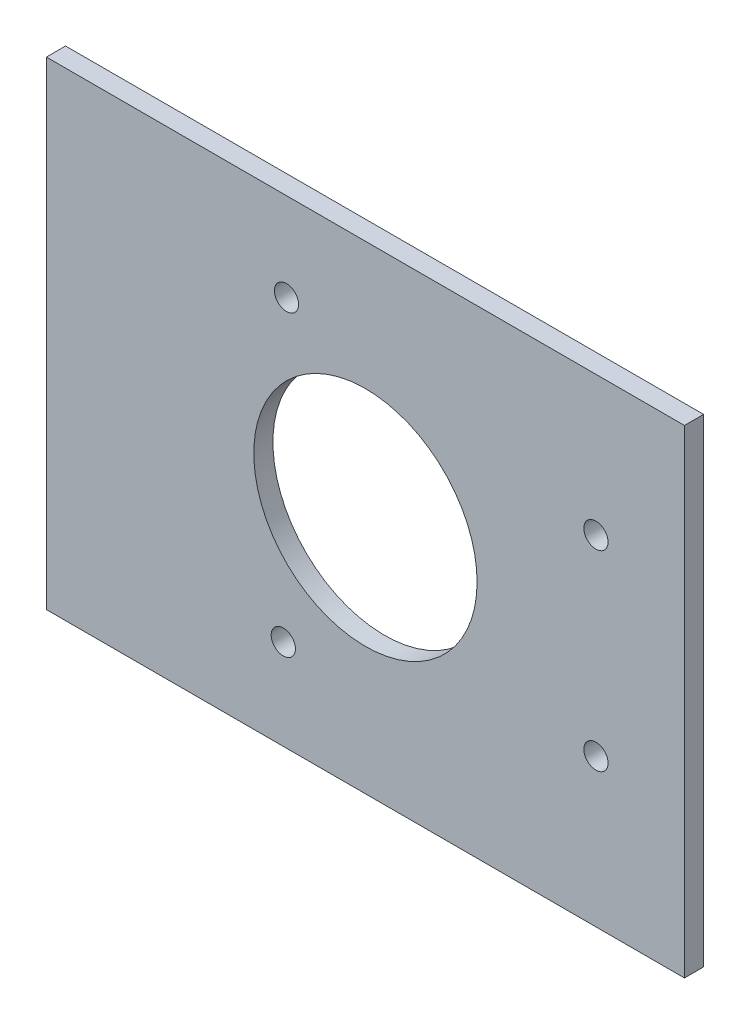
ISO-10303-21;
HEADER;
FILE_DESCRIPTION(('STEP AP214'),'2;1');
FILE_NAME('part.step','',(''),(''),'','','');
FILE_SCHEMA(('AUTOMOTIVE_DESIGN { 1 0 10303 214 1 1 1 1 }'));
ENDSEC;
DATA;
#1=APPLICATION_CONTEXT('core data for automotive mechanical design processes');
#2=APPLICATION_PROTOCOL_DEFINITION('international standard','automotive_design',2000,#1);
#3=PRODUCT_CONTEXT('',#1,'mechanical');
#4=PRODUCT('Part','Part','',(#3));
#5=PRODUCT_RELATED_PRODUCT_CATEGORY('part','',(#4));
#6=PRODUCT_DEFINITION_FORMATION('','',#4);
#7=PRODUCT_DEFINITION_CONTEXT('part definition',#1,'design');
#8=PRODUCT_DEFINITION('design','',#6,#7);
#9=PRODUCT_DEFINITION_SHAPE('','',#8);
#10=(LENGTH_UNIT() NAMED_UNIT(*) SI_UNIT(.MILLI.,.METRE.));
#11=(NAMED_UNIT(*) PLANE_ANGLE_UNIT() SI_UNIT($,.RADIAN.));
#12=(NAMED_UNIT(*) SI_UNIT($,.STERADIAN.) SOLID_ANGLE_UNIT());
#13=UNCERTAINTY_MEASURE_WITH_UNIT(LENGTH_MEASURE(1.E-05),#10,'distance_accuracy_value','');
#14=(GEOMETRIC_REPRESENTATION_CONTEXT(3) GLOBAL_UNCERTAINTY_ASSIGNED_CONTEXT((#13)) GLOBAL_UNIT_ASSIGNED_CONTEXT((#10,
#11,#12)) REPRESENTATION_CONTEXT('',''));
#15=CARTESIAN_POINT('',(0.,0.,0.));
#16=DIRECTION('',(0.,0.,1.));
#17=DIRECTION('',(1.,0.,0.));
#18=AXIS2_PLACEMENT_3D('',#15,#16,#17);
#19=CARTESIAN_POINT('',(0.,0.,3.));
#20=DIRECTION('',(0.,0.,1.));
#21=DIRECTION('',(1.,0.,0.));
#22=AXIS2_PLACEMENT_3D('',#19,#20,#21);
#23=PLANE('',#22);
#24=CARTESIAN_POINT('',(36.1287196312325,15.6737774835319,3.));
#25=DIRECTION('',(0.,0.,1.));
#26=DIRECTION('',(1.,0.,0.));
#27=AXIS2_PLACEMENT_3D('',#24,#25,#26);
#28=CIRCLE('',#27,1.9);
#29=CARTESIAN_POINT('',(38.0287196312325,15.6737774835319,3.));
#30=VERTEX_POINT('',#29);
#31=EDGE_CURVE('E133',#30,#30,#28,.T.);
#32=ORIENTED_EDGE('',*,*,#31,.F.);
#33=EDGE_LOOP('',(#32));
#34=FACE_BOUND('',#33,.T.);
#35=CARTESIAN_POINT('',(-12.8712803091628,-23.3262230976134,3.));
#36=DIRECTION('',(0.,0.,1.));
#37=DIRECTION('',(1.,0.,0.));
#38=AXIS2_PLACEMENT_3D('',#35,#36,#37);
#39=CIRCLE('',#38,1.9);
#40=CARTESIAN_POINT('',(-10.9712803091628,-23.3262230976134,3.));
#41=VERTEX_POINT('',#40);
#42=EDGE_CURVE('E121',#41,#41,#39,.T.);
#43=ORIENTED_EDGE('',*,*,#42,.F.);
#44=EDGE_LOOP('',(#43));
#45=FACE_BOUND('',#44,.T.);
#46=DIRECTION('',(0.,1.,0.));
#47=VECTOR('',#46,1.);
#48=CARTESIAN_POINT('',(50.,37.5,3.));
#49=LINE('',#48,#47);
#50=CARTESIAN_POINT('',(50.,-37.5,3.));
#51=VERTEX_POINT('',#50);
#52=CARTESIAN_POINT('',(50.,37.5,3.));
#53=VERTEX_POINT('',#52);
#54=EDGE_CURVE('E91',#51,#53,#49,.T.);
#55=ORIENTED_EDGE('',*,*,#54,.T.);
#56=DIRECTION('',(-1.,0.,0.));
#57=VECTOR('',#56,1.);
#58=CARTESIAN_POINT('',(-50.,37.5,3.));
#59=LINE('',#58,#57);
#60=CARTESIAN_POINT('',(-50.,37.5,3.));
#61=VERTEX_POINT('',#60);
#62=EDGE_CURVE('E86',#53,#61,#59,.T.);
#63=ORIENTED_EDGE('',*,*,#62,.T.);
#64=DIRECTION('',(0.,-1.,0.));
#65=VECTOR('',#64,1.);
#66=CARTESIAN_POINT('',(-50.,37.5,3.));
#67=LINE('',#66,#65);
#68=CARTESIAN_POINT('',(-50.,-37.5,3.));
#69=VERTEX_POINT('',#68);
#70=EDGE_CURVE('E89',#61,#69,#67,.T.);
#71=ORIENTED_EDGE('',*,*,#70,.T.);
#72=DIRECTION('',(1.,0.,0.));
#73=VECTOR('',#72,1.);
#74=CARTESIAN_POINT('',(-50.,-37.5,3.));
#75=LINE('',#74,#73);
#76=EDGE_CURVE('E56',#69,#51,#75,.T.);
#77=ORIENTED_EDGE('',*,*,#76,.T.);
#78=EDGE_LOOP('',(#55,#63,#71,#77));
#79=FACE_BOUND('',#78,.T.);
#80=CARTESIAN_POINT('',(0.,0.,3.));
#81=DIRECTION('',(0.,0.,1.));
#82=DIRECTION('',(1.,0.,0.));
#83=AXIS2_PLACEMENT_3D('',#80,#81,#82);
#84=CIRCLE('',#83,17.5);
#85=CARTESIAN_POINT('',(17.5,0.,3.));
#86=VERTEX_POINT('',#85);
#87=EDGE_CURVE('E106',#86,#86,#84,.T.);
#88=ORIENTED_EDGE('',*,*,#87,.F.);
#89=EDGE_LOOP('',(#88));
#90=FACE_BOUND('',#89,.T.);
#91=CARTESIAN_POINT('',(36.1287196312325,-14.3262225164681,3.));
#92=DIRECTION('',(0.,0.,1.));
#93=DIRECTION('',(1.,0.,0.));
#94=AXIS2_PLACEMENT_3D('',#91,#92,#93);
#95=CIRCLE('',#94,1.9);
#96=CARTESIAN_POINT('',(38.0287196312325,-14.3262225164681,3.));
#97=VERTEX_POINT('',#96);
#98=EDGE_CURVE('E127',#97,#97,#95,.T.);
#99=ORIENTED_EDGE('',*,*,#98,.F.);
#100=EDGE_LOOP('',(#99));
#101=FACE_BOUND('',#100,.T.);
#102=CARTESIAN_POINT('',(-12.3712808903081,23.6737776027412,3.));
#103=DIRECTION('',(0.,0.,1.));
#104=DIRECTION('',(1.,0.,0.));
#105=AXIS2_PLACEMENT_3D('',#102,#103,#104);
#106=CIRCLE('',#105,1.9);
#107=CARTESIAN_POINT('',(-10.4712808903081,23.6737776027412,3.));
#108=VERTEX_POINT('',#107);
#109=EDGE_CURVE('E139',#108,#108,#106,.T.);
#110=ORIENTED_EDGE('',*,*,#109,.F.);
#111=EDGE_LOOP('',(#110));
#112=FACE_BOUND('',#111,.T.);
#113=ADVANCED_FACE('F39',(#34,#45,#79,#90,#101,#112),#23,.T.);
#114=CARTESIAN_POINT('',(0.,0.,0.));
#115=DIRECTION('',(0.,0.,1.));
#116=DIRECTION('',(1.,0.,0.));
#117=AXIS2_PLACEMENT_3D('',#114,#115,#116);
#118=PLANE('',#117);
#119=DIRECTION('',(0.,1.,0.));
#120=VECTOR('',#119,1.);
#121=CARTESIAN_POINT('',(50.,37.5,0.));
#122=LINE('',#121,#120);
#123=CARTESIAN_POINT('',(50.,-37.5,0.));
#124=VERTEX_POINT('',#123);
#125=CARTESIAN_POINT('',(50.,37.5,0.));
#126=VERTEX_POINT('',#125);
#127=EDGE_CURVE('E103',#124,#126,#122,.T.);
#128=ORIENTED_EDGE('',*,*,#127,.F.);
#129=DIRECTION('',(1.,0.,0.));
#130=VECTOR('',#129,1.);
#131=CARTESIAN_POINT('',(-50.,-37.5,0.));
#132=LINE('',#131,#130);
#133=CARTESIAN_POINT('',(-50.,-37.5,0.));
#134=VERTEX_POINT('',#133);
#135=EDGE_CURVE('E79',#134,#124,#132,.T.);
#136=ORIENTED_EDGE('',*,*,#135,.F.);
#137=DIRECTION('',(0.,-1.,0.));
#138=VECTOR('',#137,1.);
#139=CARTESIAN_POINT('',(-50.,37.5,0.));
#140=LINE('',#139,#138);
#141=CARTESIAN_POINT('',(-50.,37.5,0.));
#142=VERTEX_POINT('',#141);
#143=EDGE_CURVE('E73',#142,#134,#140,.T.);
#144=ORIENTED_EDGE('',*,*,#143,.F.);
#145=DIRECTION('',(-1.,0.,0.));
#146=VECTOR('',#145,1.);
#147=CARTESIAN_POINT('',(-50.,37.5,0.));
#148=LINE('',#147,#146);
#149=EDGE_CURVE('E95',#126,#142,#148,.T.);
#150=ORIENTED_EDGE('',*,*,#149,.F.);
#151=EDGE_LOOP('',(#128,#136,#144,#150));
#152=FACE_BOUND('',#151,.T.);
#153=CARTESIAN_POINT('',(0.,0.,0.));
#154=DIRECTION('',(0.,0.,1.));
#155=DIRECTION('',(1.,0.,0.));
#156=AXIS2_PLACEMENT_3D('',#153,#154,#155);
#157=CIRCLE('',#156,17.5);
#158=CARTESIAN_POINT('',(17.5,0.,0.));
#159=VERTEX_POINT('',#158);
#160=EDGE_CURVE('E118',#159,#159,#157,.T.);
#161=ORIENTED_EDGE('',*,*,#160,.T.);
#162=EDGE_LOOP('',(#161));
#163=FACE_BOUND('',#162,.T.);
#164=CARTESIAN_POINT('',(-12.8712803091628,-23.3262230976134,0.));
#165=DIRECTION('',(0.,0.,1.));
#166=DIRECTION('',(1.,0.,0.));
#167=AXIS2_PLACEMENT_3D('',#164,#165,#166);
#168=CIRCLE('',#167,1.9);
#169=CARTESIAN_POINT('',(-10.9712803091628,-23.3262230976134,0.));
#170=VERTEX_POINT('',#169);
#171=EDGE_CURVE('E124',#170,#170,#168,.T.);
#172=ORIENTED_EDGE('',*,*,#171,.T.);
#173=EDGE_LOOP('',(#172));
#174=FACE_BOUND('',#173,.T.);
#175=CARTESIAN_POINT('',(36.1287196312325,-14.3262225164681,0.));
#176=DIRECTION('',(0.,0.,1.));
#177=DIRECTION('',(1.,0.,0.));
#178=AXIS2_PLACEMENT_3D('',#175,#176,#177);
#179=CIRCLE('',#178,1.9);
#180=CARTESIAN_POINT('',(38.0287196312325,-14.3262225164681,0.));
#181=VERTEX_POINT('',#180);
#182=EDGE_CURVE('E130',#181,#181,#179,.T.);
#183=ORIENTED_EDGE('',*,*,#182,.T.);
#184=EDGE_LOOP('',(#183));
#185=FACE_BOUND('',#184,.T.);
#186=CARTESIAN_POINT('',(36.1287196312325,15.6737774835319,0.));
#187=DIRECTION('',(0.,0.,1.));
#188=DIRECTION('',(1.,0.,0.));
#189=AXIS2_PLACEMENT_3D('',#186,#187,#188);
#190=CIRCLE('',#189,1.9);
#191=CARTESIAN_POINT('',(38.0287196312325,15.6737774835319,0.));
#192=VERTEX_POINT('',#191);
#193=EDGE_CURVE('E136',#192,#192,#190,.T.);
#194=ORIENTED_EDGE('',*,*,#193,.T.);
#195=EDGE_LOOP('',(#194));
#196=FACE_BOUND('',#195,.T.);
#197=CARTESIAN_POINT('',(-12.3712808903081,23.6737776027412,0.));
#198=DIRECTION('',(0.,0.,1.));
#199=DIRECTION('',(1.,0.,0.));
#200=AXIS2_PLACEMENT_3D('',#197,#198,#199);
#201=CIRCLE('',#200,1.9);
#202=CARTESIAN_POINT('',(-10.4712808903081,23.6737776027412,0.));
#203=VERTEX_POINT('',#202);
#204=EDGE_CURVE('E142',#203,#203,#201,.T.);
#205=ORIENTED_EDGE('',*,*,#204,.T.);
#206=EDGE_LOOP('',(#205));
#207=FACE_BOUND('',#206,.T.);
#208=ADVANCED_FACE('F114',(#152,#163,#174,#185,#196,#207),#118,.F.);
#209=CARTESIAN_POINT('',(50.,37.5,3.));
#210=DIRECTION('',(-1.,0.,0.));
#211=DIRECTION('',(0.,-1.,0.));
#212=AXIS2_PLACEMENT_3D('',#209,#210,#211);
#213=PLANE('',#212);
#214=ORIENTED_EDGE('',*,*,#127,.T.);
#215=DIRECTION('',(0.,0.,-1.));
#216=VECTOR('',#215,1.);
#217=CARTESIAN_POINT('',(50.,37.5,3.));
#218=LINE('',#217,#216);
#219=EDGE_CURVE('E11',#53,#126,#218,.T.);
#220=ORIENTED_EDGE('',*,*,#219,.F.);
#221=ORIENTED_EDGE('',*,*,#54,.F.);
#222=DIRECTION('',(0.,0.,-1.));
#223=VECTOR('',#222,1.);
#224=CARTESIAN_POINT('',(50.,-37.5,3.));
#225=LINE('',#224,#223);
#226=EDGE_CURVE('E99',#51,#124,#225,.T.);
#227=ORIENTED_EDGE('',*,*,#226,.T.);
#228=EDGE_LOOP('',(#214,#220,#221,#227));
#229=FACE_BOUND('',#228,.T.);
#230=ADVANCED_FACE('F41',(#229),#213,.F.);
#231=CARTESIAN_POINT('',(-50.,37.5,3.));
#232=DIRECTION('',(0.,-1.,0.));
#233=DIRECTION('',(0.,0.,-1.));
#234=AXIS2_PLACEMENT_3D('',#231,#232,#233);
#235=PLANE('',#234);
#236=ORIENTED_EDGE('',*,*,#149,.T.);
#237=DIRECTION('',(0.,0.,-1.));
#238=VECTOR('',#237,1.);
#239=CARTESIAN_POINT('',(-50.,37.5,3.));
#240=LINE('',#239,#238);
#241=EDGE_CURVE('E48',#61,#142,#240,.T.);
#242=ORIENTED_EDGE('',*,*,#241,.F.);
#243=ORIENTED_EDGE('',*,*,#62,.F.);
#244=ORIENTED_EDGE('',*,*,#219,.T.);
#245=EDGE_LOOP('',(#236,#242,#243,#244));
#246=FACE_BOUND('',#245,.T.);
#247=ADVANCED_FACE('F94',(#246),#235,.F.);
#248=CARTESIAN_POINT('',(-50.,37.5,3.));
#249=DIRECTION('',(1.,0.,0.));
#250=DIRECTION('',(0.,1.,0.));
#251=AXIS2_PLACEMENT_3D('',#248,#249,#250);
#252=PLANE('',#251);
#253=ORIENTED_EDGE('',*,*,#143,.T.);
#254=DIRECTION('',(0.,0.,-1.));
#255=VECTOR('',#254,1.);
#256=CARTESIAN_POINT('',(-50.,-37.5,3.));
#257=LINE('',#256,#255);
#258=EDGE_CURVE('E96',#69,#134,#257,.T.);
#259=ORIENTED_EDGE('',*,*,#258,.F.);
#260=ORIENTED_EDGE('',*,*,#70,.F.);
#261=ORIENTED_EDGE('',*,*,#241,.T.);
#262=EDGE_LOOP('',(#253,#259,#260,#261));
#263=FACE_BOUND('',#262,.T.);
#264=ADVANCED_FACE('F97',(#263),#252,.F.);
#265=CARTESIAN_POINT('',(-50.,-37.5,3.));
#266=DIRECTION('',(0.,1.,0.));
#267=DIRECTION('',(0.,0.,1.));
#268=AXIS2_PLACEMENT_3D('',#265,#266,#267);
#269=PLANE('',#268);
#270=ORIENTED_EDGE('',*,*,#135,.T.);
#271=ORIENTED_EDGE('',*,*,#226,.F.);
#272=ORIENTED_EDGE('',*,*,#76,.F.);
#273=ORIENTED_EDGE('',*,*,#258,.T.);
#274=EDGE_LOOP('',(#270,#271,#272,#273));
#275=FACE_BOUND('',#274,.T.);
#276=ADVANCED_FACE('F111',(#275),#269,.F.);
#277=CARTESIAN_POINT('',(0.,0.,3.));
#278=DIRECTION('',(0.,0.,-1.));
#279=DIRECTION('',(-1.,0.,0.));
#280=AXIS2_PLACEMENT_3D('',#277,#278,#279);
#281=CYLINDRICAL_SURFACE('',#280,17.5);
#282=ORIENTED_EDGE('',*,*,#87,.T.);
#283=EDGE_LOOP('',(#282));
#284=FACE_BOUND('',#283,.T.);
#285=ORIENTED_EDGE('',*,*,#160,.F.);
#286=EDGE_LOOP('',(#285));
#287=FACE_BOUND('',#286,.T.);
#288=ADVANCED_FACE('F161',(#284,#287),#281,.F.);
#289=CARTESIAN_POINT('',(-12.8712803091628,-23.3262230976134,3.));
#290=DIRECTION('',(0.,0.,-1.));
#291=DIRECTION('',(-1.,0.,0.));
#292=AXIS2_PLACEMENT_3D('',#289,#290,#291);
#293=CYLINDRICAL_SURFACE('',#292,1.9);
#294=ORIENTED_EDGE('',*,*,#42,.T.);
#295=EDGE_LOOP('',(#294));
#296=FACE_BOUND('',#295,.T.);
#297=ORIENTED_EDGE('',*,*,#171,.F.);
#298=EDGE_LOOP('',(#297));
#299=FACE_BOUND('',#298,.T.);
#300=ADVANCED_FACE('F206',(#296,#299),#293,.F.);
#301=CARTESIAN_POINT('',(36.1287196312325,-14.3262225164681,3.));
#302=DIRECTION('',(0.,0.,-1.));
#303=DIRECTION('',(-1.,0.,0.));
#304=AXIS2_PLACEMENT_3D('',#301,#302,#303);
#305=CYLINDRICAL_SURFACE('',#304,1.9);
#306=ORIENTED_EDGE('',*,*,#98,.T.);
#307=EDGE_LOOP('',(#306));
#308=FACE_BOUND('',#307,.T.);
#309=ORIENTED_EDGE('',*,*,#182,.F.);
#310=EDGE_LOOP('',(#309));
#311=FACE_BOUND('',#310,.T.);
#312=ADVANCED_FACE('F214',(#308,#311),#305,.F.);
#313=CARTESIAN_POINT('',(36.1287196312325,15.6737774835319,3.));
#314=DIRECTION('',(0.,0.,-1.));
#315=DIRECTION('',(-1.,0.,0.));
#316=AXIS2_PLACEMENT_3D('',#313,#314,#315);
#317=CYLINDRICAL_SURFACE('',#316,1.9);
#318=ORIENTED_EDGE('',*,*,#31,.T.);
#319=EDGE_LOOP('',(#318));
#320=FACE_BOUND('',#319,.T.);
#321=ORIENTED_EDGE('',*,*,#193,.F.);
#322=EDGE_LOOP('',(#321));
#323=FACE_BOUND('',#322,.T.);
#324=ADVANCED_FACE('F222',(#320,#323),#317,.F.);
#325=CARTESIAN_POINT('',(-12.3712808903081,23.6737776027412,3.));
#326=DIRECTION('',(0.,0.,-1.));
#327=DIRECTION('',(-1.,0.,0.));
#328=AXIS2_PLACEMENT_3D('',#325,#326,#327);
#329=CYLINDRICAL_SURFACE('',#328,1.9);
#330=ORIENTED_EDGE('',*,*,#109,.T.);
#331=EDGE_LOOP('',(#330));
#332=FACE_BOUND('',#331,.T.);
#333=ORIENTED_EDGE('',*,*,#204,.F.);
#334=EDGE_LOOP('',(#333));
#335=FACE_BOUND('',#334,.T.);
#336=ADVANCED_FACE('F148',(#332,#335),#329,.F.);
#337=CLOSED_SHELL('',(#113,#208,#230,#247,#264,#276,#288,#300,#312,#324,#336));
#338=MANIFOLD_SOLID_BREP('B2',#337);
#339=ADVANCED_BREP_SHAPE_REPRESENTATION('',(#18,#338),#14);
#340=SHAPE_DEFINITION_REPRESENTATION(#9,#339);
ENDSEC;
END-ISO-10303-21;
